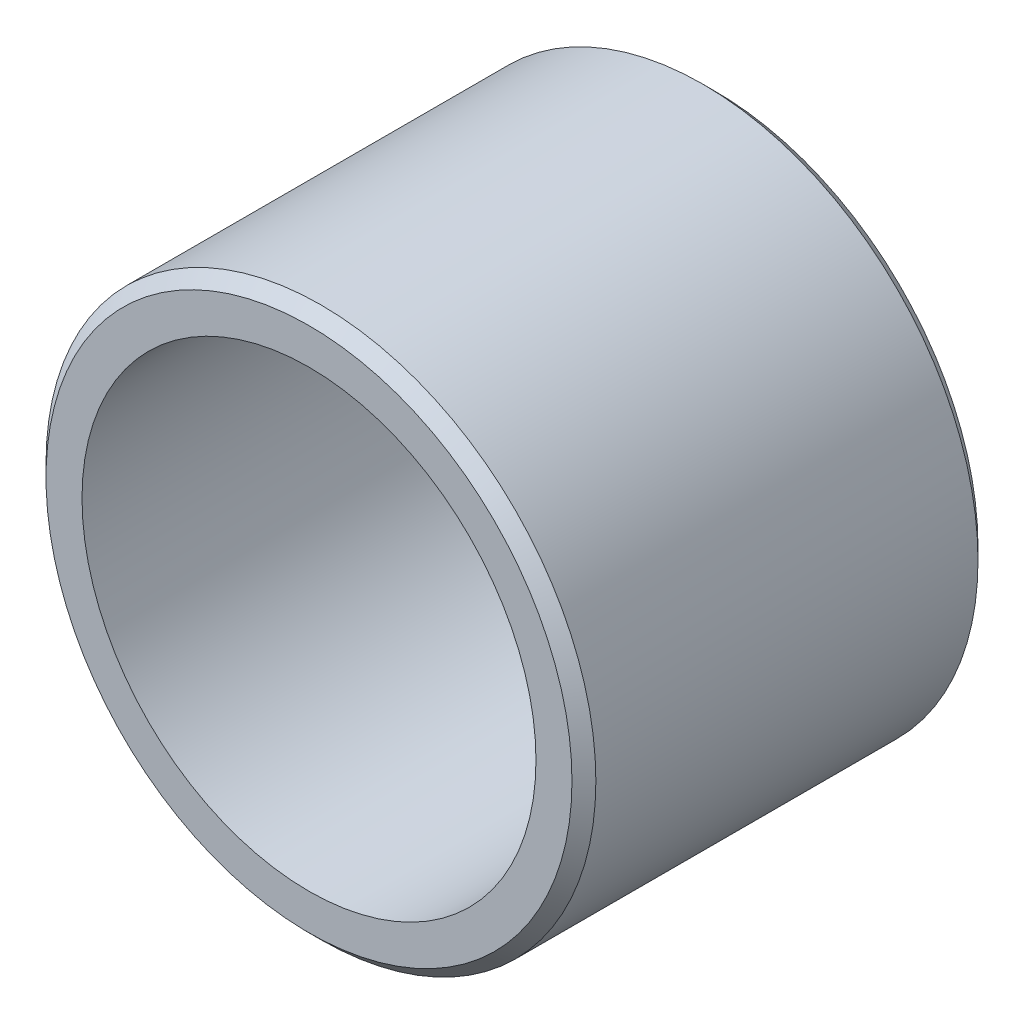
ISO-10303-21;
HEADER;
FILE_DESCRIPTION(('STEP AP214'),'2;1');
FILE_NAME('part.step','',(''),(''),'','','');
FILE_SCHEMA(('AUTOMOTIVE_DESIGN { 1 0 10303 214 1 1 1 1 }'));
ENDSEC;
DATA;
#1=APPLICATION_CONTEXT('core data for automotive mechanical design processes');
#2=APPLICATION_PROTOCOL_DEFINITION('international standard','automotive_design',2000,#1);
#3=PRODUCT_CONTEXT('',#1,'mechanical');
#4=PRODUCT('Part','Part','',(#3));
#5=PRODUCT_RELATED_PRODUCT_CATEGORY('part','',(#4));
#6=PRODUCT_DEFINITION_FORMATION('','',#4);
#7=PRODUCT_DEFINITION_CONTEXT('part definition',#1,'design');
#8=PRODUCT_DEFINITION('design','',#6,#7);
#9=PRODUCT_DEFINITION_SHAPE('','',#8);
#10=(LENGTH_UNIT() NAMED_UNIT(*) SI_UNIT(.MILLI.,.METRE.));
#11=(NAMED_UNIT(*) PLANE_ANGLE_UNIT() SI_UNIT($,.RADIAN.));
#12=(NAMED_UNIT(*) SI_UNIT($,.STERADIAN.) SOLID_ANGLE_UNIT());
#13=UNCERTAINTY_MEASURE_WITH_UNIT(LENGTH_MEASURE(1.E-05),#10,'distance_accuracy_value','');
#14=(GEOMETRIC_REPRESENTATION_CONTEXT(3) GLOBAL_UNCERTAINTY_ASSIGNED_CONTEXT((#13)) GLOBAL_UNIT_ASSIGNED_CONTEXT((#10,
#11,#12)) REPRESENTATION_CONTEXT('',''));
#15=CARTESIAN_POINT('',(0.,0.,0.));
#16=DIRECTION('',(0.,0.,1.));
#17=DIRECTION('',(1.,0.,0.));
#18=AXIS2_PLACEMENT_3D('',#15,#16,#17);
#19=CARTESIAN_POINT('',(0.,0.,-16.9926));
#20=DIRECTION('',(0.,0.,1.));
#21=DIRECTION('',(1.,0.,0.));
#22=AXIS2_PLACEMENT_3D('',#19,#20,#21);
#23=CYLINDRICAL_SURFACE('',#22,11.5062);
#24=CARTESIAN_POINT('',(0.,0.,-16.4926));
#25=DIRECTION('',(0.,0.,1.));
#26=DIRECTION('',(1.,0.,0.));
#27=AXIS2_PLACEMENT_3D('',#24,#25,#26);
#28=CIRCLE('',#27,11.5062);
#29=CARTESIAN_POINT('',(11.5062,0.,-16.4926));
#30=VERTEX_POINT('',#29);
#31=EDGE_CURVE('E49',#30,#30,#28,.T.);
#32=ORIENTED_EDGE('',*,*,#31,.T.);
#33=EDGE_LOOP('',(#32));
#34=FACE_BOUND('',#33,.T.);
#35=CARTESIAN_POINT('',(0.,0.,-0.499999999999997));
#36=DIRECTION('',(0.,0.,1.));
#37=DIRECTION('',(1.,0.,0.));
#38=AXIS2_PLACEMENT_3D('',#35,#36,#37);
#39=CIRCLE('',#38,11.5062);
#40=CARTESIAN_POINT('',(11.5062,0.,-0.499999999999997));
#41=VERTEX_POINT('',#40);
#42=EDGE_CURVE('E53',#41,#41,#39,.F.);
#43=ORIENTED_EDGE('',*,*,#42,.T.);
#44=EDGE_LOOP('',(#43));
#45=FACE_BOUND('',#44,.T.);
#46=ADVANCED_FACE('F37',(#34,#45),#23,.T.);
#47=CARTESIAN_POINT('',(0.,0.,-16.9926));
#48=DIRECTION('',(0.,0.,1.));
#49=DIRECTION('',(1.,0.,0.));
#50=AXIS2_PLACEMENT_3D('',#47,#48,#49);
#51=PLANE('',#50);
#52=CARTESIAN_POINT('',(0.,0.,-16.9926));
#53=DIRECTION('',(0.,0.,1.));
#54=DIRECTION('',(1.,0.,0.));
#55=AXIS2_PLACEMENT_3D('',#52,#53,#54);
#56=CIRCLE('',#55,11.0062);
#57=CARTESIAN_POINT('',(11.0062,0.,-16.9926));
#58=VERTEX_POINT('',#57);
#59=EDGE_CURVE('E45',#58,#58,#56,.F.);
#60=ORIENTED_EDGE('',*,*,#59,.T.);
#61=EDGE_LOOP('',(#60));
#62=FACE_BOUND('',#61,.T.);
#63=CARTESIAN_POINT('',(0.,0.,-16.9926));
#64=DIRECTION('',(0.,0.,1.));
#65=DIRECTION('',(1.,0.,0.));
#66=AXIS2_PLACEMENT_3D('',#63,#64,#65);
#67=CIRCLE('',#66,9.4996);
#68=CARTESIAN_POINT('',(9.4996,0.,-16.9926));
#69=VERTEX_POINT('',#68);
#70=EDGE_CURVE('E58',#69,#69,#67,.T.);
#71=ORIENTED_EDGE('',*,*,#70,.T.);
#72=EDGE_LOOP('',(#71));
#73=FACE_BOUND('',#72,.T.);
#74=ADVANCED_FACE('F65',(#62,#73),#51,.F.);
#75=CARTESIAN_POINT('',(0.,0.,0.));
#76=DIRECTION('',(0.,0.,1.));
#77=DIRECTION('',(1.,0.,0.));
#78=AXIS2_PLACEMENT_3D('',#75,#76,#77);
#79=PLANE('',#78);
#80=CARTESIAN_POINT('',(0.,0.,0.));
#81=DIRECTION('',(0.,0.,1.));
#82=DIRECTION('',(1.,0.,0.));
#83=AXIS2_PLACEMENT_3D('',#80,#81,#82);
#84=CIRCLE('',#83,11.0062);
#85=CARTESIAN_POINT('',(11.0062,0.,0.));
#86=VERTEX_POINT('',#85);
#87=EDGE_CURVE('E10',#86,#86,#84,.T.);
#88=ORIENTED_EDGE('',*,*,#87,.T.);
#89=EDGE_LOOP('',(#88));
#90=FACE_BOUND('',#89,.T.);
#91=CARTESIAN_POINT('',(0.,0.,0.));
#92=DIRECTION('',(0.,0.,1.));
#93=DIRECTION('',(1.,0.,0.));
#94=AXIS2_PLACEMENT_3D('',#91,#92,#93);
#95=CIRCLE('',#94,9.4996);
#96=CARTESIAN_POINT('',(9.4996,0.,0.));
#97=VERTEX_POINT('',#96);
#98=EDGE_CURVE('E59',#97,#97,#95,.T.);
#99=ORIENTED_EDGE('',*,*,#98,.F.);
#100=EDGE_LOOP('',(#99));
#101=FACE_BOUND('',#100,.T.);
#102=ADVANCED_FACE('F71',(#90,#101),#79,.T.);
#103=CARTESIAN_POINT('',(0.,0.,-16.9926));
#104=DIRECTION('',(0.,0.,1.));
#105=DIRECTION('',(1.,0.,0.));
#106=AXIS2_PLACEMENT_3D('',#103,#104,#105);
#107=CYLINDRICAL_SURFACE('',#106,9.4996);
#108=ORIENTED_EDGE('',*,*,#70,.F.);
#109=EDGE_LOOP('',(#108));
#110=FACE_BOUND('',#109,.T.);
#111=ORIENTED_EDGE('',*,*,#98,.T.);
#112=EDGE_LOOP('',(#111));
#113=FACE_BOUND('',#112,.T.);
#114=ADVANCED_FACE('F67',(#110,#113),#107,.F.);
#115=CARTESIAN_POINT('',(0.,0.,-16.4926));
#116=DIRECTION('',(0.,0.,1.));
#117=DIRECTION('',(1.,0.,0.));
#118=AXIS2_PLACEMENT_3D('',#115,#116,#117);
#119=CONICAL_SURFACE('',#118,11.5062,0.785398163397455);
#120=ORIENTED_EDGE('',*,*,#59,.F.);
#121=EDGE_LOOP('',(#120));
#122=FACE_BOUND('',#121,.T.);
#123=ORIENTED_EDGE('',*,*,#31,.F.);
#124=EDGE_LOOP('',(#123));
#125=FACE_BOUND('',#124,.T.);
#126=ADVANCED_FACE('F70',(#122,#125),#119,.T.);
#127=CARTESIAN_POINT('',(0.,0.,0.));
#128=DIRECTION('',(0.,0.,-1.));
#129=DIRECTION('',(-1.,0.,0.));
#130=AXIS2_PLACEMENT_3D('',#127,#128,#129);
#131=CONICAL_SURFACE('',#130,11.0062,0.785398163397441);
#132=ORIENTED_EDGE('',*,*,#42,.F.);
#133=EDGE_LOOP('',(#132));
#134=FACE_BOUND('',#133,.T.);
#135=ORIENTED_EDGE('',*,*,#87,.F.);
#136=EDGE_LOOP('',(#135));
#137=FACE_BOUND('',#136,.T.);
#138=ADVANCED_FACE('F40',(#134,#137),#131,.T.);
#139=CLOSED_SHELL('',(#46,#74,#102,#114,#126,#138));
#140=MANIFOLD_SOLID_BREP('B2',#139);
#141=ADVANCED_BREP_SHAPE_REPRESENTATION('',(#18,#140),#14);
#142=SHAPE_DEFINITION_REPRESENTATION(#9,#141);
ENDSEC;
END-ISO-10303-21;
